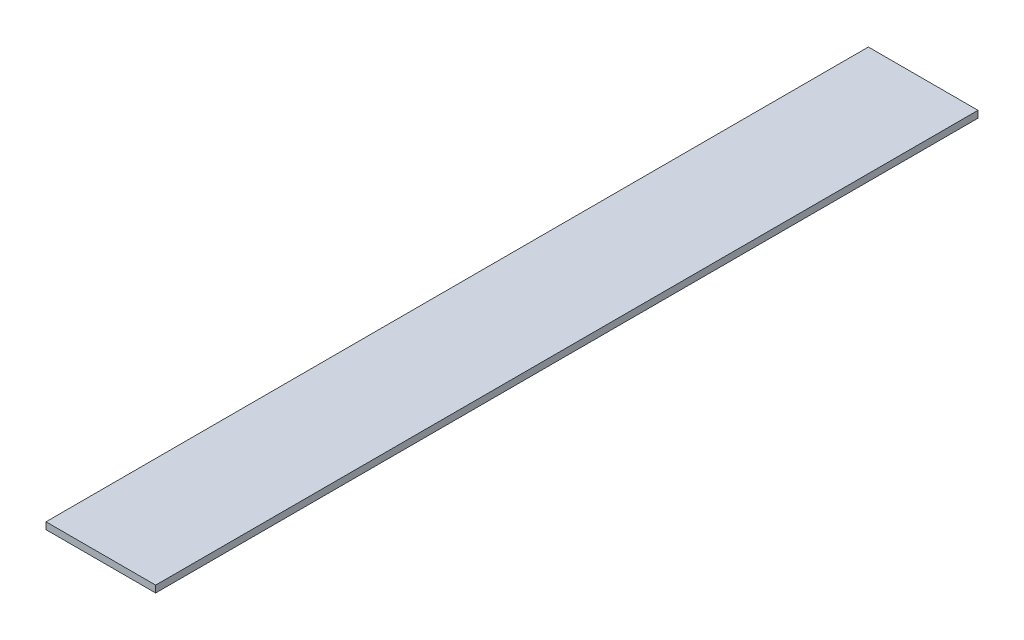
ISO-10303-21;
HEADER;
FILE_DESCRIPTION(('STEP AP214'),'2;1');
FILE_NAME('part.step','',(''),(''),'','','');
FILE_SCHEMA(('AUTOMOTIVE_DESIGN { 1 0 10303 214 1 1 1 1 }'));
ENDSEC;
DATA;
#1=APPLICATION_CONTEXT('core data for automotive mechanical design processes');
#2=APPLICATION_PROTOCOL_DEFINITION('international standard','automotive_design',2000,#1);
#3=PRODUCT_CONTEXT('',#1,'mechanical');
#4=PRODUCT('Part','Part','',(#3));
#5=PRODUCT_RELATED_PRODUCT_CATEGORY('part','',(#4));
#6=PRODUCT_DEFINITION_FORMATION('','',#4);
#7=PRODUCT_DEFINITION_CONTEXT('part definition',#1,'design');
#8=PRODUCT_DEFINITION('design','',#6,#7);
#9=PRODUCT_DEFINITION_SHAPE('','',#8);
#10=(LENGTH_UNIT() NAMED_UNIT(*) SI_UNIT(.MILLI.,.METRE.));
#11=(NAMED_UNIT(*) PLANE_ANGLE_UNIT() SI_UNIT($,.RADIAN.));
#12=(NAMED_UNIT(*) SI_UNIT($,.STERADIAN.) SOLID_ANGLE_UNIT());
#13=UNCERTAINTY_MEASURE_WITH_UNIT(LENGTH_MEASURE(1.E-05),#10,'distance_accuracy_value','');
#14=(GEOMETRIC_REPRESENTATION_CONTEXT(3) GLOBAL_UNCERTAINTY_ASSIGNED_CONTEXT((#13)) GLOBAL_UNIT_ASSIGNED_CONTEXT((#10,
#11,#12)) REPRESENTATION_CONTEXT('',''));
#15=CARTESIAN_POINT('',(0.,0.,0.));
#16=DIRECTION('',(0.,0.,1.));
#17=DIRECTION('',(1.,0.,0.));
#18=AXIS2_PLACEMENT_3D('',#15,#16,#17);
#19=CARTESIAN_POINT('',(522.946000099182,-3.175,190.5));
#20=DIRECTION('',(-1.,0.,0.));
#21=DIRECTION('',(0.,0.,1.));
#22=AXIS2_PLACEMENT_3D('',#19,#20,#21);
#23=PLANE('',#22);
#24=DIRECTION('',(0.,0.,1.));
#25=VECTOR('',#24,1.);
#26=CARTESIAN_POINT('',(522.946000099182,0.,190.5));
#27=LINE('',#26,#25);
#28=CARTESIAN_POINT('',(522.946000099182,0.,0.));
#29=VERTEX_POINT('',#28);
#30=CARTESIAN_POINT('',(522.946000099182,0.,381.));
#31=VERTEX_POINT('',#30);
#32=EDGE_CURVE('E99',#29,#31,#27,.T.);
#33=ORIENTED_EDGE('',*,*,#32,.F.);
#34=DIRECTION('',(0.,1.,0.));
#35=VECTOR('',#34,1.);
#36=CARTESIAN_POINT('',(522.946000099182,-3.175,0.));
#37=LINE('',#36,#35);
#38=CARTESIAN_POINT('',(522.946000099182,-3.175,0.));
#39=VERTEX_POINT('',#38);
#40=EDGE_CURVE('E9',#39,#29,#37,.T.);
#41=ORIENTED_EDGE('',*,*,#40,.F.);
#42=DIRECTION('',(0.,0.,1.));
#43=VECTOR('',#42,1.);
#44=CARTESIAN_POINT('',(522.946000099182,-3.175,190.5));
#45=LINE('',#44,#43);
#46=CARTESIAN_POINT('',(522.946000099182,-3.175,381.));
#47=VERTEX_POINT('',#46);
#48=EDGE_CURVE('E77',#39,#47,#45,.T.);
#49=ORIENTED_EDGE('',*,*,#48,.T.);
#50=DIRECTION('',(0.,1.,0.));
#51=VECTOR('',#50,1.);
#52=CARTESIAN_POINT('',(522.946000099182,-3.175,381.));
#53=LINE('',#52,#51);
#54=EDGE_CURVE('E36',#47,#31,#53,.T.);
#55=ORIENTED_EDGE('',*,*,#54,.T.);
#56=EDGE_LOOP('',(#33,#41,#49,#55));
#57=FACE_BOUND('',#56,.T.);
#58=ADVANCED_FACE('F14',(#57),#23,.T.);
#59=CARTESIAN_POINT('',(548.346000099182,-3.175,0.));
#60=DIRECTION('',(0.,0.,1.));
#61=DIRECTION('',(1.,0.,0.));
#62=AXIS2_PLACEMENT_3D('',#59,#60,#61);
#63=PLANE('',#62);
#64=DIRECTION('',(1.,0.,0.));
#65=VECTOR('',#64,1.);
#66=CARTESIAN_POINT('',(548.346000099182,0.,0.));
#67=LINE('',#66,#65);
#68=CARTESIAN_POINT('',(573.746000099182,0.,0.));
#69=VERTEX_POINT('',#68);
#70=EDGE_CURVE('E84',#29,#69,#67,.T.);
#71=ORIENTED_EDGE('',*,*,#70,.T.);
#72=DIRECTION('',(0.,1.,0.));
#73=VECTOR('',#72,1.);
#74=CARTESIAN_POINT('',(573.746000099182,-3.175,0.));
#75=LINE('',#74,#73);
#76=CARTESIAN_POINT('',(573.746000099182,-3.175,0.));
#77=VERTEX_POINT('',#76);
#78=EDGE_CURVE('E23',#77,#69,#75,.T.);
#79=ORIENTED_EDGE('',*,*,#78,.F.);
#80=DIRECTION('',(1.,0.,0.));
#81=VECTOR('',#80,1.);
#82=CARTESIAN_POINT('',(548.346000099182,-3.175,0.));
#83=LINE('',#82,#81);
#84=EDGE_CURVE('E71',#39,#77,#83,.T.);
#85=ORIENTED_EDGE('',*,*,#84,.F.);
#86=ORIENTED_EDGE('',*,*,#40,.T.);
#87=EDGE_LOOP('',(#71,#79,#85,#86));
#88=FACE_BOUND('',#87,.T.);
#89=ADVANCED_FACE('F82',(#88),#63,.F.);
#90=CARTESIAN_POINT('',(573.746000099182,-3.175,190.5));
#91=DIRECTION('',(-1.,0.,0.));
#92=DIRECTION('',(0.,0.,1.));
#93=AXIS2_PLACEMENT_3D('',#90,#91,#92);
#94=PLANE('',#93);
#95=DIRECTION('',(0.,0.,1.));
#96=VECTOR('',#95,1.);
#97=CARTESIAN_POINT('',(573.746000099182,0.,190.5));
#98=LINE('',#97,#96);
#99=CARTESIAN_POINT('',(573.746000099182,0.,381.));
#100=VERTEX_POINT('',#99);
#101=EDGE_CURVE('E104',#69,#100,#98,.T.);
#102=ORIENTED_EDGE('',*,*,#101,.T.);
#103=DIRECTION('',(0.,1.,0.));
#104=VECTOR('',#103,1.);
#105=CARTESIAN_POINT('',(573.746000099182,-3.175,381.));
#106=LINE('',#105,#104);
#107=CARTESIAN_POINT('',(573.746000099182,-3.175,381.));
#108=VERTEX_POINT('',#107);
#109=EDGE_CURVE('E54',#108,#100,#106,.T.);
#110=ORIENTED_EDGE('',*,*,#109,.F.);
#111=DIRECTION('',(0.,0.,1.));
#112=VECTOR('',#111,1.);
#113=CARTESIAN_POINT('',(573.746000099182,-3.175,190.5));
#114=LINE('',#113,#112);
#115=EDGE_CURVE('E76',#77,#108,#114,.T.);
#116=ORIENTED_EDGE('',*,*,#115,.F.);
#117=ORIENTED_EDGE('',*,*,#78,.T.);
#118=EDGE_LOOP('',(#102,#110,#116,#117));
#119=FACE_BOUND('',#118,.T.);
#120=ADVANCED_FACE('F88',(#119),#94,.F.);
#121=CARTESIAN_POINT('',(548.346000099182,-3.175,381.));
#122=DIRECTION('',(0.,0.,1.));
#123=DIRECTION('',(1.,0.,0.));
#124=AXIS2_PLACEMENT_3D('',#121,#122,#123);
#125=PLANE('',#124);
#126=DIRECTION('',(1.,0.,0.));
#127=VECTOR('',#126,1.);
#128=CARTESIAN_POINT('',(548.346000099182,0.,381.));
#129=LINE('',#128,#127);
#130=EDGE_CURVE('E106',#31,#100,#129,.T.);
#131=ORIENTED_EDGE('',*,*,#130,.F.);
#132=ORIENTED_EDGE('',*,*,#54,.F.);
#133=DIRECTION('',(1.,0.,0.));
#134=VECTOR('',#133,1.);
#135=CARTESIAN_POINT('',(548.346000099182,-3.175,381.));
#136=LINE('',#135,#134);
#137=EDGE_CURVE('E90',#47,#108,#136,.T.);
#138=ORIENTED_EDGE('',*,*,#137,.T.);
#139=ORIENTED_EDGE('',*,*,#109,.T.);
#140=EDGE_LOOP('',(#131,#132,#138,#139));
#141=FACE_BOUND('',#140,.T.);
#142=ADVANCED_FACE('F125',(#141),#125,.T.);
#143=CARTESIAN_POINT('',(548.346000099182,-3.175,190.5));
#144=DIRECTION('',(0.,-1.,0.));
#145=DIRECTION('',(1.,0.,0.));
#146=AXIS2_PLACEMENT_3D('',#143,#144,#145);
#147=PLANE('',#146);
#148=ORIENTED_EDGE('',*,*,#48,.F.);
#149=ORIENTED_EDGE('',*,*,#84,.T.);
#150=ORIENTED_EDGE('',*,*,#115,.T.);
#151=ORIENTED_EDGE('',*,*,#137,.F.);
#152=EDGE_LOOP('',(#148,#149,#150,#151));
#153=FACE_BOUND('',#152,.T.);
#154=ADVANCED_FACE('F73',(#153),#147,.T.);
#155=CARTESIAN_POINT('',(548.346000099182,0.,190.5));
#156=DIRECTION('',(0.,-1.,0.));
#157=DIRECTION('',(1.,0.,0.));
#158=AXIS2_PLACEMENT_3D('',#155,#156,#157);
#159=PLANE('',#158);
#160=ORIENTED_EDGE('',*,*,#32,.T.);
#161=ORIENTED_EDGE('',*,*,#130,.T.);
#162=ORIENTED_EDGE('',*,*,#101,.F.);
#163=ORIENTED_EDGE('',*,*,#70,.F.);
#164=EDGE_LOOP('',(#160,#161,#162,#163));
#165=FACE_BOUND('',#164,.T.);
#166=ADVANCED_FACE('F133',(#165),#159,.F.);
#167=CLOSED_SHELL('',(#58,#89,#120,#142,#154,#166));
#168=MANIFOLD_SOLID_BREP('B1',#167);
#169=ADVANCED_BREP_SHAPE_REPRESENTATION('',(#18,#168),#14);
#170=SHAPE_DEFINITION_REPRESENTATION(#9,#169);
ENDSEC;
END-ISO-10303-21;
